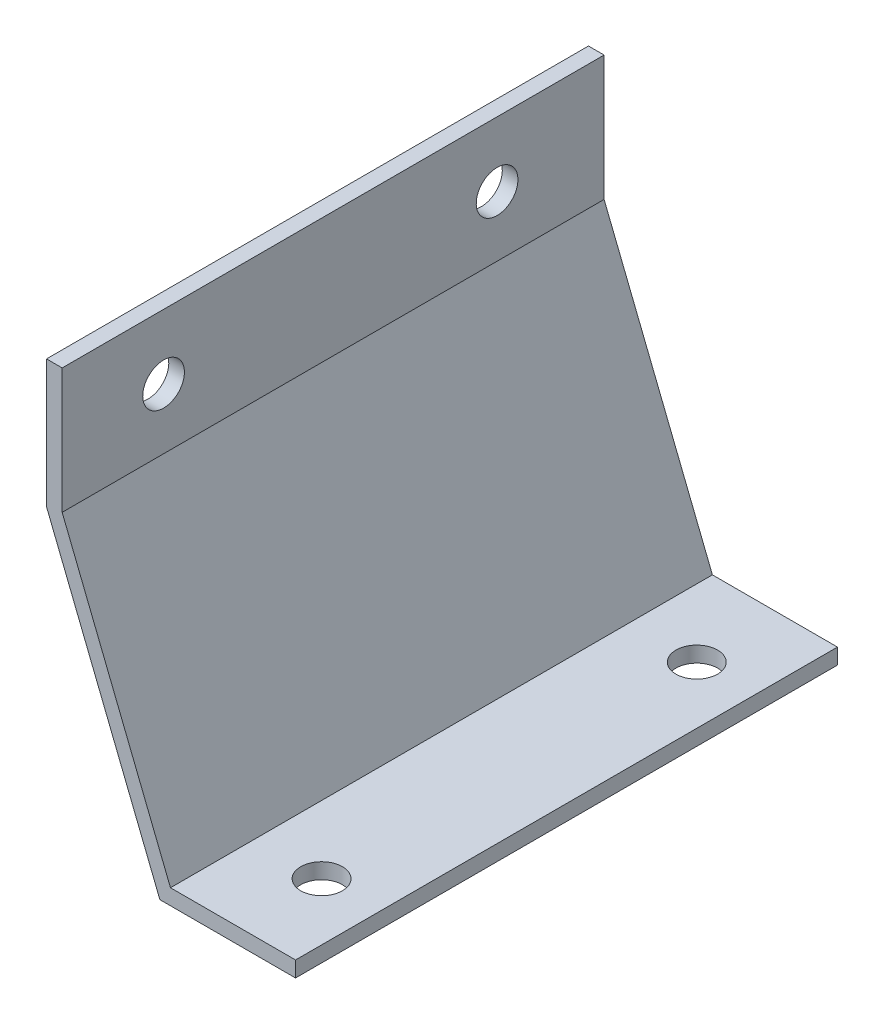
ISO-10303-21;
HEADER;
FILE_DESCRIPTION(('STEP AP214'),'2;1');
FILE_NAME('part.step','',(''),(''),'','','');
FILE_SCHEMA(('AUTOMOTIVE_DESIGN { 1 0 10303 214 1 1 1 1 }'));
ENDSEC;
DATA;
#1=APPLICATION_CONTEXT('core data for automotive mechanical design processes');
#2=APPLICATION_PROTOCOL_DEFINITION('international standard','automotive_design',2000,#1);
#3=PRODUCT_CONTEXT('',#1,'mechanical');
#4=PRODUCT('Part','Part','',(#3));
#5=PRODUCT_RELATED_PRODUCT_CATEGORY('part','',(#4));
#6=PRODUCT_DEFINITION_FORMATION('','',#4);
#7=PRODUCT_DEFINITION_CONTEXT('part definition',#1,'design');
#8=PRODUCT_DEFINITION('design','',#6,#7);
#9=PRODUCT_DEFINITION_SHAPE('','',#8);
#10=(LENGTH_UNIT() NAMED_UNIT(*) SI_UNIT(.MILLI.,.METRE.));
#11=(NAMED_UNIT(*) PLANE_ANGLE_UNIT() SI_UNIT($,.RADIAN.));
#12=(NAMED_UNIT(*) SI_UNIT($,.STERADIAN.) SOLID_ANGLE_UNIT());
#13=UNCERTAINTY_MEASURE_WITH_UNIT(LENGTH_MEASURE(1.E-05),#10,'distance_accuracy_value','');
#14=(GEOMETRIC_REPRESENTATION_CONTEXT(3) GLOBAL_UNCERTAINTY_ASSIGNED_CONTEXT((#13)) GLOBAL_UNIT_ASSIGNED_CONTEXT((#10,
#11,#12)) REPRESENTATION_CONTEXT('',''));
#15=CARTESIAN_POINT('',(0.,0.,0.));
#16=DIRECTION('',(0.,0.,1.));
#17=DIRECTION('',(1.,0.,0.));
#18=AXIS2_PLACEMENT_3D('',#15,#16,#17);
#19=CARTESIAN_POINT('',(32.9955678841871,-4.7625,165.1));
#20=DIRECTION('',(0.,1.,0.));
#21=DIRECTION('',(0.,0.,1.));
#22=AXIS2_PLACEMENT_3D('',#19,#20,#21);
#23=PLANE('',#22);
#24=CARTESIAN_POINT('',(53.6330678841871,-4.7625,25.4));
#25=DIRECTION('',(0.,1.,0.));
#26=DIRECTION('',(0.,0.,1.));
#27=AXIS2_PLACEMENT_3D('',#24,#25,#26);
#28=CIRCLE('',#27,6.35);
#29=CARTESIAN_POINT('',(53.6330678841871,-4.7625,31.75));
#30=VERTEX_POINT('',#29);
#31=EDGE_CURVE('E188',#30,#30,#28,.T.);
#32=ORIENTED_EDGE('',*,*,#31,.T.);
#33=EDGE_LOOP('',(#32));
#34=FACE_BOUND('',#33,.T.);
#35=CARTESIAN_POINT('',(53.6330678841871,-4.7625,139.7));
#36=DIRECTION('',(0.,1.,0.));
#37=DIRECTION('',(0.,0.,1.));
#38=AXIS2_PLACEMENT_3D('',#35,#36,#37);
#39=CIRCLE('',#38,6.35);
#40=CARTESIAN_POINT('',(53.6330678841871,-4.7625,146.05));
#41=VERTEX_POINT('',#40);
#42=EDGE_CURVE('E199',#41,#41,#39,.T.);
#43=ORIENTED_EDGE('',*,*,#42,.T.);
#44=EDGE_LOOP('',(#43));
#45=FACE_BOUND('',#44,.T.);
#46=DIRECTION('',(1.,0.,0.));
#47=VECTOR('',#46,1.);
#48=CARTESIAN_POINT('',(32.9955678841871,-4.7625,0.));
#49=LINE('',#48,#47);
#50=CARTESIAN_POINT('',(29.7703121851979,-4.7625,0.));
#51=VERTEX_POINT('',#50);
#52=CARTESIAN_POINT('',(71.0955678841871,-4.7625,0.));
#53=VERTEX_POINT('',#52);
#54=EDGE_CURVE('E136',#51,#53,#49,.T.);
#55=ORIENTED_EDGE('',*,*,#54,.T.);
#56=DIRECTION('',(0.,0.,-1.));
#57=VECTOR('',#56,1.);
#58=CARTESIAN_POINT('',(71.0955678841871,-4.7625,165.1));
#59=LINE('',#58,#57);
#60=CARTESIAN_POINT('',(71.0955678841871,-4.7625,165.1));
#61=VERTEX_POINT('',#60);
#62=EDGE_CURVE('E11',#61,#53,#59,.T.);
#63=ORIENTED_EDGE('',*,*,#62,.F.);
#64=DIRECTION('',(1.,0.,0.));
#65=VECTOR('',#64,1.);
#66=CARTESIAN_POINT('',(32.9955678841871,-4.7625,165.1));
#67=LINE('',#66,#65);
#68=CARTESIAN_POINT('',(29.7703121851979,-4.7625,165.1));
#69=VERTEX_POINT('',#68);
#70=EDGE_CURVE('E94',#69,#61,#67,.T.);
#71=ORIENTED_EDGE('',*,*,#70,.F.);
#72=DIRECTION('',(0.,0.,-1.));
#73=VECTOR('',#72,1.);
#74=CARTESIAN_POINT('',(29.7703121851979,-4.7625,165.1));
#75=LINE('',#74,#73);
#76=EDGE_CURVE('E135',#69,#51,#75,.T.);
#77=ORIENTED_EDGE('',*,*,#76,.T.);
#78=EDGE_LOOP('',(#55,#63,#71,#77));
#79=FACE_BOUND('',#78,.T.);
#80=ADVANCED_FACE('F39',(#34,#45,#79),#23,.F.);
#81=CARTESIAN_POINT('',(71.0955678841871,0.,165.1));
#82=DIRECTION('',(1.,0.,0.));
#83=DIRECTION('',(0.,1.,0.));
#84=AXIS2_PLACEMENT_3D('',#81,#82,#83);
#85=PLANE('',#84);
#86=DIRECTION('',(0.,-1.,0.));
#87=VECTOR('',#86,1.);
#88=CARTESIAN_POINT('',(71.0955678841871,0.,0.));
#89=LINE('',#88,#87);
#90=CARTESIAN_POINT('',(71.0955678841871,0.,0.));
#91=VERTEX_POINT('',#90);
#92=EDGE_CURVE('E139',#91,#53,#89,.T.);
#93=ORIENTED_EDGE('',*,*,#92,.F.);
#94=DIRECTION('',(0.,0.,-1.));
#95=VECTOR('',#94,1.);
#96=CARTESIAN_POINT('',(71.0955678841871,0.,165.1));
#97=LINE('',#96,#95);
#98=CARTESIAN_POINT('',(71.0955678841871,0.,165.1));
#99=VERTEX_POINT('',#98);
#100=EDGE_CURVE('E47',#99,#91,#97,.T.);
#101=ORIENTED_EDGE('',*,*,#100,.F.);
#102=DIRECTION('',(0.,-1.,0.));
#103=VECTOR('',#102,1.);
#104=CARTESIAN_POINT('',(71.0955678841871,0.,165.1));
#105=LINE('',#104,#103);
#106=EDGE_CURVE('E179',#99,#61,#105,.T.);
#107=ORIENTED_EDGE('',*,*,#106,.T.);
#108=ORIENTED_EDGE('',*,*,#62,.T.);
#109=EDGE_LOOP('',(#93,#101,#107,#108));
#110=FACE_BOUND('',#109,.T.);
#111=ADVANCED_FACE('F170',(#110),#85,.T.);
#112=CARTESIAN_POINT('',(32.9955678841871,0.,165.1));
#113=DIRECTION('',(0.,1.,0.));
#114=DIRECTION('',(0.,0.,1.));
#115=AXIS2_PLACEMENT_3D('',#112,#113,#114);
#116=PLANE('',#115);
#117=CARTESIAN_POINT('',(53.6330678841871,0.,25.4));
#118=DIRECTION('',(0.,1.,0.));
#119=DIRECTION('',(0.,0.,1.));
#120=AXIS2_PLACEMENT_3D('',#117,#118,#119);
#121=CIRCLE('',#120,6.35);
#122=CARTESIAN_POINT('',(53.6330678841871,0.,31.75));
#123=VERTEX_POINT('',#122);
#124=EDGE_CURVE('E202',#123,#123,#121,.T.);
#125=ORIENTED_EDGE('',*,*,#124,.F.);
#126=EDGE_LOOP('',(#125));
#127=FACE_BOUND('',#126,.T.);
#128=CARTESIAN_POINT('',(53.6330678841871,0.,139.7));
#129=DIRECTION('',(0.,1.,0.));
#130=DIRECTION('',(0.,0.,1.));
#131=AXIS2_PLACEMENT_3D('',#128,#129,#130);
#132=CIRCLE('',#131,6.35);
#133=CARTESIAN_POINT('',(53.6330678841871,0.,146.05));
#134=VERTEX_POINT('',#133);
#135=EDGE_CURVE('E196',#134,#134,#132,.T.);
#136=ORIENTED_EDGE('',*,*,#135,.F.);
#137=EDGE_LOOP('',(#136));
#138=FACE_BOUND('',#137,.T.);
#139=DIRECTION('',(1.,0.,0.));
#140=VECTOR('',#139,1.);
#141=CARTESIAN_POINT('',(32.9955678841871,0.,0.));
#142=LINE('',#141,#140);
#143=CARTESIAN_POINT('',(32.9955678841871,0.,0.));
#144=VERTEX_POINT('',#143);
#145=EDGE_CURVE('E143',#144,#91,#142,.T.);
#146=ORIENTED_EDGE('',*,*,#145,.F.);
#147=DIRECTION('',(0.,0.,-1.));
#148=VECTOR('',#147,1.);
#149=CARTESIAN_POINT('',(32.9955678841871,0.,165.1));
#150=LINE('',#149,#148);
#151=CARTESIAN_POINT('',(32.9955678841871,0.,165.1));
#152=VERTEX_POINT('',#151);
#153=EDGE_CURVE('E160',#152,#144,#150,.T.);
#154=ORIENTED_EDGE('',*,*,#153,.F.);
#155=DIRECTION('',(1.,0.,0.));
#156=VECTOR('',#155,1.);
#157=CARTESIAN_POINT('',(32.9955678841871,0.,165.1));
#158=LINE('',#157,#156);
#159=EDGE_CURVE('E167',#152,#99,#158,.T.);
#160=ORIENTED_EDGE('',*,*,#159,.T.);
#161=ORIENTED_EDGE('',*,*,#100,.T.);
#162=EDGE_LOOP('',(#146,#154,#160,#161));
#163=FACE_BOUND('',#162,.T.);
#164=ADVANCED_FACE('F165',(#127,#138,#163),#116,.T.);
#165=CARTESIAN_POINT('',(0.,82.55,165.1));
#166=DIRECTION('',(0.928571428571429,0.371153744479045,0.));
#167=DIRECTION('',(-0.371153744479045,0.928571428571429,0.));
#168=AXIS2_PLACEMENT_3D('',#165,#166,#167);
#169=PLANE('',#168);
#170=DIRECTION('',(0.371153744479045,-0.928571428571429,0.));
#171=VECTOR('',#170,1.);
#172=CARTESIAN_POINT('',(0.,82.55,0.));
#173=LINE('',#172,#171);
#174=CARTESIAN_POINT('',(0.,82.55,0.));
#175=VERTEX_POINT('',#174);
#176=EDGE_CURVE('E146',#175,#144,#173,.T.);
#177=ORIENTED_EDGE('',*,*,#176,.F.);
#178=DIRECTION('',(0.,0.,-1.));
#179=VECTOR('',#178,1.);
#180=CARTESIAN_POINT('',(0.,82.55,165.1));
#181=LINE('',#180,#179);
#182=CARTESIAN_POINT('',(0.,82.55,165.1));
#183=VERTEX_POINT('',#182);
#184=EDGE_CURVE('E158',#183,#175,#181,.T.);
#185=ORIENTED_EDGE('',*,*,#184,.F.);
#186=DIRECTION('',(0.371153744479045,-0.928571428571429,0.));
#187=VECTOR('',#186,1.);
#188=CARTESIAN_POINT('',(0.,82.55,165.1));
#189=LINE('',#188,#187);
#190=EDGE_CURVE('E130',#183,#152,#189,.T.);
#191=ORIENTED_EDGE('',*,*,#190,.T.);
#192=ORIENTED_EDGE('',*,*,#153,.T.);
#193=EDGE_LOOP('',(#177,#185,#191,#192));
#194=FACE_BOUND('',#193,.T.);
#195=ADVANCED_FACE('F177',(#194),#169,.T.);
#196=CARTESIAN_POINT('',(0.,120.65,165.1));
#197=DIRECTION('',(1.,0.,0.));
#198=DIRECTION('',(0.,1.,0.));
#199=AXIS2_PLACEMENT_3D('',#196,#197,#198);
#200=PLANE('',#199);
#201=CARTESIAN_POINT('',(0.,100.942277040049,134.204880656957));
#202=DIRECTION('',(1.,0.,0.));
#203=DIRECTION('',(0.,1.,0.));
#204=AXIS2_PLACEMENT_3D('',#201,#202,#203);
#205=CIRCLE('',#204,6.34999999999999);
#206=CARTESIAN_POINT('',(0.,107.292277040049,134.204880656957));
#207=VERTEX_POINT('',#206);
#208=EDGE_CURVE('E191',#207,#207,#205,.T.);
#209=ORIENTED_EDGE('',*,*,#208,.F.);
#210=EDGE_LOOP('',(#209));
#211=FACE_BOUND('',#210,.T.);
#212=CARTESIAN_POINT('',(0.,100.942277040049,32.6048806569568));
#213=DIRECTION('',(1.,0.,0.));
#214=DIRECTION('',(0.,1.,0.));
#215=AXIS2_PLACEMENT_3D('',#212,#213,#214);
#216=CIRCLE('',#215,6.35);
#217=CARTESIAN_POINT('',(0.,107.292277040049,32.6048806569568));
#218=VERTEX_POINT('',#217);
#219=EDGE_CURVE('E184',#218,#218,#216,.T.);
#220=ORIENTED_EDGE('',*,*,#219,.F.);
#221=EDGE_LOOP('',(#220));
#222=FACE_BOUND('',#221,.T.);
#223=DIRECTION('',(0.,-1.,0.));
#224=VECTOR('',#223,1.);
#225=CARTESIAN_POINT('',(0.,120.65,0.));
#226=LINE('',#225,#224);
#227=CARTESIAN_POINT('',(0.,120.65,0.));
#228=VERTEX_POINT('',#227);
#229=EDGE_CURVE('E149',#228,#175,#226,.T.);
#230=ORIENTED_EDGE('',*,*,#229,.F.);
#231=DIRECTION('',(0.,0.,-1.));
#232=VECTOR('',#231,1.);
#233=CARTESIAN_POINT('',(0.,120.65,165.1));
#234=LINE('',#233,#232);
#235=CARTESIAN_POINT('',(0.,120.65,165.1));
#236=VERTEX_POINT('',#235);
#237=EDGE_CURVE('E118',#236,#228,#234,.T.);
#238=ORIENTED_EDGE('',*,*,#237,.F.);
#239=DIRECTION('',(0.,-1.,0.));
#240=VECTOR('',#239,1.);
#241=CARTESIAN_POINT('',(0.,120.65,165.1));
#242=LINE('',#241,#240);
#243=EDGE_CURVE('E128',#236,#183,#242,.T.);
#244=ORIENTED_EDGE('',*,*,#243,.T.);
#245=ORIENTED_EDGE('',*,*,#184,.T.);
#246=EDGE_LOOP('',(#230,#238,#244,#245));
#247=FACE_BOUND('',#246,.T.);
#248=ADVANCED_FACE('F244',(#211,#222,#247),#200,.T.);
#249=CARTESIAN_POINT('',(-4.7625,120.65,165.1));
#250=DIRECTION('',(0.,1.,0.));
#251=DIRECTION('',(0.,0.,1.));
#252=AXIS2_PLACEMENT_3D('',#249,#250,#251);
#253=PLANE('',#252);
#254=DIRECTION('',(1.,0.,0.));
#255=VECTOR('',#254,1.);
#256=CARTESIAN_POINT('',(-4.7625,120.65,0.));
#257=LINE('',#256,#255);
#258=CARTESIAN_POINT('',(-4.7625,120.65,0.));
#259=VERTEX_POINT('',#258);
#260=EDGE_CURVE('E117',#259,#228,#257,.T.);
#261=ORIENTED_EDGE('',*,*,#260,.F.);
#262=DIRECTION('',(0.,0.,-1.));
#263=VECTOR('',#262,1.);
#264=CARTESIAN_POINT('',(-4.7625,120.65,165.1));
#265=LINE('',#264,#263);
#266=CARTESIAN_POINT('',(-4.7625,120.65,165.1));
#267=VERTEX_POINT('',#266);
#268=EDGE_CURVE('E111',#267,#259,#265,.T.);
#269=ORIENTED_EDGE('',*,*,#268,.F.);
#270=DIRECTION('',(1.,0.,0.));
#271=VECTOR('',#270,1.);
#272=CARTESIAN_POINT('',(-4.7625,120.65,165.1));
#273=LINE('',#272,#271);
#274=EDGE_CURVE('E115',#267,#236,#273,.T.);
#275=ORIENTED_EDGE('',*,*,#274,.T.);
#276=ORIENTED_EDGE('',*,*,#237,.T.);
#277=EDGE_LOOP('',(#261,#269,#275,#276));
#278=FACE_BOUND('',#277,.T.);
#279=ADVANCED_FACE('F113',(#278),#253,.T.);
#280=CARTESIAN_POINT('',(-4.7625,120.65,165.1));
#281=DIRECTION('',(1.,0.,0.));
#282=DIRECTION('',(0.,1.,0.));
#283=AXIS2_PLACEMENT_3D('',#280,#281,#282);
#284=PLANE('',#283);
#285=CARTESIAN_POINT('',(-4.76250000000001,100.942277040049,134.204880656957));
#286=DIRECTION('',(1.,0.,0.));
#287=DIRECTION('',(0.,1.,0.));
#288=AXIS2_PLACEMENT_3D('',#285,#286,#287);
#289=CIRCLE('',#288,6.34999999999999);
#290=CARTESIAN_POINT('',(-4.76250000000001,107.292277040049,134.204880656957));
#291=VERTEX_POINT('',#290);
#292=EDGE_CURVE('E140',#291,#291,#289,.T.);
#293=ORIENTED_EDGE('',*,*,#292,.T.);
#294=EDGE_LOOP('',(#293));
#295=FACE_BOUND('',#294,.T.);
#296=CARTESIAN_POINT('',(-4.76250000000001,100.942277040049,32.6048806569568));
#297=DIRECTION('',(1.,0.,0.));
#298=DIRECTION('',(0.,1.,0.));
#299=AXIS2_PLACEMENT_3D('',#296,#297,#298);
#300=CIRCLE('',#299,6.35);
#301=CARTESIAN_POINT('',(-4.76250000000001,107.292277040049,32.6048806569568));
#302=VERTEX_POINT('',#301);
#303=EDGE_CURVE('E187',#302,#302,#300,.T.);
#304=ORIENTED_EDGE('',*,*,#303,.T.);
#305=EDGE_LOOP('',(#304));
#306=FACE_BOUND('',#305,.T.);
#307=DIRECTION('',(0.,-1.,0.));
#308=VECTOR('',#307,1.);
#309=CARTESIAN_POINT('',(-4.7625,120.65,0.));
#310=LINE('',#309,#308);
#311=CARTESIAN_POINT('',(-4.76249999999999,81.6334564476615,0.));
#312=VERTEX_POINT('',#311);
#313=EDGE_CURVE('E82',#259,#312,#310,.T.);
#314=ORIENTED_EDGE('',*,*,#313,.T.);
#315=DIRECTION('',(0.,0.,-1.));
#316=VECTOR('',#315,1.);
#317=CARTESIAN_POINT('',(-4.76249999999999,81.6334564476615,165.1));
#318=LINE('',#317,#316);
#319=CARTESIAN_POINT('',(-4.76249999999999,81.6334564476615,165.1));
#320=VERTEX_POINT('',#319);
#321=EDGE_CURVE('E119',#320,#312,#318,.T.);
#322=ORIENTED_EDGE('',*,*,#321,.F.);
#323=DIRECTION('',(0.,-1.,0.));
#324=VECTOR('',#323,1.);
#325=CARTESIAN_POINT('',(-4.7625,120.65,165.1));
#326=LINE('',#325,#324);
#327=EDGE_CURVE('E121',#267,#320,#326,.T.);
#328=ORIENTED_EDGE('',*,*,#327,.F.);
#329=ORIENTED_EDGE('',*,*,#268,.T.);
#330=EDGE_LOOP('',(#314,#322,#328,#329));
#331=FACE_BOUND('',#330,.T.);
#332=ADVANCED_FACE('F122',(#295,#306,#331),#284,.F.);
#333=CARTESIAN_POINT('',(-4.42232142857143,80.7823802919185,165.1));
#334=DIRECTION('',(0.928571428571429,0.371153744479045,0.));
#335=DIRECTION('',(-0.371153744479045,0.928571428571429,0.));
#336=AXIS2_PLACEMENT_3D('',#333,#334,#335);
#337=PLANE('',#336);
#338=DIRECTION('',(0.371153744479045,-0.928571428571429,0.));
#339=VECTOR('',#338,1.);
#340=CARTESIAN_POINT('',(-4.42232142857143,80.7823802919185,0.));
#341=LINE('',#340,#339);
#342=EDGE_CURVE('E88',#312,#51,#341,.T.);
#343=ORIENTED_EDGE('',*,*,#342,.T.);
#344=ORIENTED_EDGE('',*,*,#76,.F.);
#345=DIRECTION('',(0.371153744479045,-0.928571428571429,0.));
#346=VECTOR('',#345,1.);
#347=CARTESIAN_POINT('',(-4.42232142857143,80.7823802919185,165.1));
#348=LINE('',#347,#346);
#349=EDGE_CURVE('E55',#320,#69,#348,.T.);
#350=ORIENTED_EDGE('',*,*,#349,.F.);
#351=ORIENTED_EDGE('',*,*,#321,.T.);
#352=EDGE_LOOP('',(#343,#344,#350,#351));
#353=FACE_BOUND('',#352,.T.);
#354=ADVANCED_FACE('F252',(#353),#337,.F.);
#355=CARTESIAN_POINT('',(0.,0.,165.1));
#356=DIRECTION('',(0.,0.,-1.));
#357=DIRECTION('',(-1.,0.,0.));
#358=AXIS2_PLACEMENT_3D('',#355,#356,#357);
#359=PLANE('',#358);
#360=ORIENTED_EDGE('',*,*,#70,.T.);
#361=ORIENTED_EDGE('',*,*,#106,.F.);
#362=ORIENTED_EDGE('',*,*,#159,.F.);
#363=ORIENTED_EDGE('',*,*,#190,.F.);
#364=ORIENTED_EDGE('',*,*,#243,.F.);
#365=ORIENTED_EDGE('',*,*,#274,.F.);
#366=ORIENTED_EDGE('',*,*,#327,.T.);
#367=ORIENTED_EDGE('',*,*,#349,.T.);
#368=EDGE_LOOP('',(#360,#361,#362,#363,#364,#365,#366,#367));
#369=FACE_BOUND('',#368,.T.);
#370=ADVANCED_FACE('F125',(#369),#359,.F.);
#371=CARTESIAN_POINT('',(0.,0.,0.));
#372=DIRECTION('',(0.,0.,-1.));
#373=DIRECTION('',(-1.,0.,0.));
#374=AXIS2_PLACEMENT_3D('',#371,#372,#373);
#375=PLANE('',#374);
#376=ORIENTED_EDGE('',*,*,#54,.F.);
#377=ORIENTED_EDGE('',*,*,#342,.F.);
#378=ORIENTED_EDGE('',*,*,#313,.F.);
#379=ORIENTED_EDGE('',*,*,#260,.T.);
#380=ORIENTED_EDGE('',*,*,#229,.T.);
#381=ORIENTED_EDGE('',*,*,#176,.T.);
#382=ORIENTED_EDGE('',*,*,#145,.T.);
#383=ORIENTED_EDGE('',*,*,#92,.T.);
#384=EDGE_LOOP('',(#376,#377,#378,#379,#380,#381,#382,#383));
#385=FACE_BOUND('',#384,.T.);
#386=ADVANCED_FACE('F173',(#385),#375,.T.);
#387=CARTESIAN_POINT('',(-4.76250000000001,100.942277040049,32.6048806569568));
#388=DIRECTION('',(1.,0.,0.));
#389=DIRECTION('',(0.,1.,0.));
#390=AXIS2_PLACEMENT_3D('',#387,#388,#389);
#391=CYLINDRICAL_SURFACE('',#390,6.35);
#392=ORIENTED_EDGE('',*,*,#303,.F.);
#393=EDGE_LOOP('',(#392));
#394=FACE_BOUND('',#393,.T.);
#395=ORIENTED_EDGE('',*,*,#219,.T.);
#396=EDGE_LOOP('',(#395));
#397=FACE_BOUND('',#396,.T.);
#398=ADVANCED_FACE('F229',(#394,#397),#391,.F.);
#399=CARTESIAN_POINT('',(-4.76250000000001,100.942277040049,134.204880656957));
#400=DIRECTION('',(1.,0.,0.));
#401=DIRECTION('',(0.,1.,0.));
#402=AXIS2_PLACEMENT_3D('',#399,#400,#401);
#403=CYLINDRICAL_SURFACE('',#402,6.34999999999999);
#404=ORIENTED_EDGE('',*,*,#292,.F.);
#405=EDGE_LOOP('',(#404));
#406=FACE_BOUND('',#405,.T.);
#407=ORIENTED_EDGE('',*,*,#208,.T.);
#408=EDGE_LOOP('',(#407));
#409=FACE_BOUND('',#408,.T.);
#410=ADVANCED_FACE('F223',(#406,#409),#403,.F.);
#411=CARTESIAN_POINT('',(53.6330678841871,-4.7625,139.7));
#412=DIRECTION('',(0.,1.,0.));
#413=DIRECTION('',(0.,0.,1.));
#414=AXIS2_PLACEMENT_3D('',#411,#412,#413);
#415=CYLINDRICAL_SURFACE('',#414,6.35);
#416=ORIENTED_EDGE('',*,*,#42,.F.);
#417=EDGE_LOOP('',(#416));
#418=FACE_BOUND('',#417,.T.);
#419=ORIENTED_EDGE('',*,*,#135,.T.);
#420=EDGE_LOOP('',(#419));
#421=FACE_BOUND('',#420,.T.);
#422=ADVANCED_FACE('F213',(#418,#421),#415,.F.);
#423=CARTESIAN_POINT('',(53.6330678841871,-4.7625,25.4));
#424=DIRECTION('',(0.,1.,0.));
#425=DIRECTION('',(0.,0.,1.));
#426=AXIS2_PLACEMENT_3D('',#423,#424,#425);
#427=CYLINDRICAL_SURFACE('',#426,6.35);
#428=ORIENTED_EDGE('',*,*,#31,.F.);
#429=EDGE_LOOP('',(#428));
#430=FACE_BOUND('',#429,.T.);
#431=ORIENTED_EDGE('',*,*,#124,.T.);
#432=EDGE_LOOP('',(#431));
#433=FACE_BOUND('',#432,.T.);
#434=ADVANCED_FACE('F210',(#430,#433),#427,.F.);
#435=CLOSED_SHELL('',(#80,#111,#164,#195,#248,#279,#332,#354,#370,#386,#398,#410,#422,#434));
#436=MANIFOLD_SOLID_BREP('B2',#435);
#437=ADVANCED_BREP_SHAPE_REPRESENTATION('',(#18,#436),#14);
#438=SHAPE_DEFINITION_REPRESENTATION(#9,#437);
ENDSEC;
END-ISO-10303-21;
